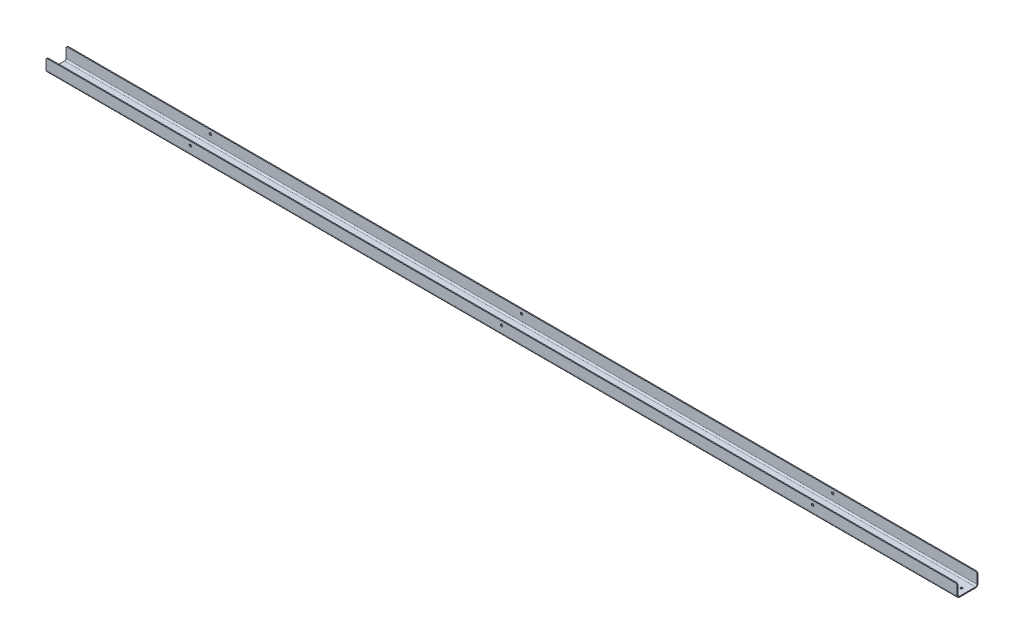
ISO-10303-21;
HEADER;
FILE_DESCRIPTION(('STEP AP214'),'2;1');
FILE_NAME('part.step','',(''),(''),'','','');
FILE_SCHEMA(('AUTOMOTIVE_DESIGN { 1 0 10303 214 1 1 1 1 }'));
ENDSEC;
DATA;
#1=APPLICATION_CONTEXT('core data for automotive mechanical design processes');
#2=APPLICATION_PROTOCOL_DEFINITION('international standard','automotive_design',2000,#1);
#3=PRODUCT_CONTEXT('',#1,'mechanical');
#4=PRODUCT('Part','Part','',(#3));
#5=PRODUCT_RELATED_PRODUCT_CATEGORY('part','',(#4));
#6=PRODUCT_DEFINITION_FORMATION('','',#4);
#7=PRODUCT_DEFINITION_CONTEXT('part definition',#1,'design');
#8=PRODUCT_DEFINITION('design','',#6,#7);
#9=PRODUCT_DEFINITION_SHAPE('','',#8);
#10=(LENGTH_UNIT() NAMED_UNIT(*) SI_UNIT(.MILLI.,.METRE.));
#11=(NAMED_UNIT(*) PLANE_ANGLE_UNIT() SI_UNIT($,.RADIAN.));
#12=(NAMED_UNIT(*) SI_UNIT($,.STERADIAN.) SOLID_ANGLE_UNIT());
#13=UNCERTAINTY_MEASURE_WITH_UNIT(LENGTH_MEASURE(1.E-05),#10,'distance_accuracy_value','');
#14=(GEOMETRIC_REPRESENTATION_CONTEXT(3) GLOBAL_UNCERTAINTY_ASSIGNED_CONTEXT((#13)) GLOBAL_UNIT_ASSIGNED_CONTEXT((#10,
#11,#12)) REPRESENTATION_CONTEXT('',''));
#15=CARTESIAN_POINT('',(0.,0.,0.));
#16=DIRECTION('',(0.,0.,1.));
#17=DIRECTION('',(1.,0.,0.));
#18=AXIS2_PLACEMENT_3D('',#15,#16,#17);
#19=CARTESIAN_POINT('',(1928.8125,5.207,0.));
#20=DIRECTION('',(1.,0.,0.));
#21=DIRECTION('',(0.,0.,-1.));
#22=AXIS2_PLACEMENT_3D('',#19,#20,#21);
#23=PLANE('',#22);
#24=DIRECTION('',(0.,0.,-1.));
#25=VECTOR('',#24,1.);
#26=CARTESIAN_POINT('',(1928.8125,5.207,0.));
#27=LINE('',#26,#25);
#28=CARTESIAN_POINT('',(1928.8125,5.207,0.));
#29=VERTEX_POINT('',#28);
#30=CARTESIAN_POINT('',(1928.8125,5.207,-2.032));
#31=VERTEX_POINT('',#30);
#32=EDGE_CURVE('E314',#29,#31,#27,.T.);
#33=ORIENTED_EDGE('',*,*,#32,.F.);
#34=CARTESIAN_POINT('',(1928.8125,5.207,-5.207));
#35=DIRECTION('',(-1.,0.,0.));
#36=DIRECTION('',(0.,0.,1.));
#37=AXIS2_PLACEMENT_3D('',#34,#35,#36);
#38=CIRCLE('',#37,5.207);
#39=CARTESIAN_POINT('',(1928.8125,0.,-5.207));
#40=VERTEX_POINT('',#39);
#41=EDGE_CURVE('E211',#29,#40,#38,.F.);
#42=ORIENTED_EDGE('',*,*,#41,.T.);
#43=DIRECTION('',(0.,-1.,0.));
#44=VECTOR('',#43,1.);
#45=CARTESIAN_POINT('',(1928.8125,2.032,-5.207));
#46=LINE('',#45,#44);
#47=CARTESIAN_POINT('',(1928.8125,2.032,-5.207));
#48=VERTEX_POINT('',#47);
#49=EDGE_CURVE('E311',#48,#40,#46,.T.);
#50=ORIENTED_EDGE('',*,*,#49,.F.);
#51=CARTESIAN_POINT('',(1928.8125,5.207,-5.207));
#52=DIRECTION('',(1.,0.,0.));
#53=DIRECTION('',(0.,0.,-1.));
#54=AXIS2_PLACEMENT_3D('',#51,#52,#53);
#55=CIRCLE('',#54,3.175);
#56=EDGE_CURVE('E198',#31,#48,#55,.T.);
#57=ORIENTED_EDGE('',*,*,#56,.F.);
#58=EDGE_LOOP('',(#33,#42,#50,#57));
#59=FACE_BOUND('',#58,.T.);
#60=ADVANCED_FACE('F42',(#59),#23,.T.);
#61=CARTESIAN_POINT('',(1928.8125,2.032,-5.207));
#62=DIRECTION('',(1.,0.,0.));
#63=DIRECTION('',(0.,0.,-1.));
#64=AXIS2_PLACEMENT_3D('',#61,#62,#63);
#65=PLANE('',#64);
#66=DIRECTION('',(0.,-1.,0.));
#67=VECTOR('',#66,1.);
#68=CARTESIAN_POINT('',(1928.8125,27.432,-2.032));
#69=LINE('',#68,#67);
#70=CARTESIAN_POINT('',(1928.8125,24.257,-2.032));
#71=VERTEX_POINT('',#70);
#72=EDGE_CURVE('E205',#71,#31,#69,.T.);
#73=ORIENTED_EDGE('',*,*,#72,.F.);
#74=DIRECTION('',(0.,0.,-1.));
#75=VECTOR('',#74,1.);
#76=CARTESIAN_POINT('',(1928.8125,24.257,-5.207));
#77=LINE('',#76,#75);
#78=CARTESIAN_POINT('',(1928.8125,24.257,0.));
#79=VERTEX_POINT('',#78);
#80=EDGE_CURVE('E331',#71,#79,#77,.F.);
#81=ORIENTED_EDGE('',*,*,#80,.T.);
#82=DIRECTION('',(0.,-1.,0.));
#83=VECTOR('',#82,1.);
#84=CARTESIAN_POINT('',(1928.8125,27.432,0.));
#85=LINE('',#84,#83);
#86=EDGE_CURVE('E208',#79,#29,#85,.T.);
#87=ORIENTED_EDGE('',*,*,#86,.T.);
#88=ORIENTED_EDGE('',*,*,#32,.T.);
#89=EDGE_LOOP('',(#73,#81,#87,#88));
#90=FACE_BOUND('',#89,.T.);
#91=ADVANCED_FACE('F402',(#90),#65,.T.);
#92=CARTESIAN_POINT('',(0.,0.,-5.207));
#93=DIRECTION('',(-1.,0.,0.));
#94=DIRECTION('',(0.,0.,1.));
#95=AXIS2_PLACEMENT_3D('',#92,#93,#94);
#96=PLANE('',#95);
#97=DIRECTION('',(0.,1.,0.));
#98=VECTOR('',#97,1.);
#99=CARTESIAN_POINT('',(0.,0.,-5.207));
#100=LINE('',#99,#98);
#101=CARTESIAN_POINT('',(0.,0.,-5.207));
#102=VERTEX_POINT('',#101);
#103=CARTESIAN_POINT('',(0.,2.032,-5.207));
#104=VERTEX_POINT('',#103);
#105=EDGE_CURVE('E308',#102,#104,#100,.T.);
#106=ORIENTED_EDGE('',*,*,#105,.F.);
#107=CARTESIAN_POINT('',(0.,5.207,-5.207));
#108=DIRECTION('',(-1.,0.,0.));
#109=DIRECTION('',(0.,0.,1.));
#110=AXIS2_PLACEMENT_3D('',#107,#108,#109);
#111=CIRCLE('',#110,5.207);
#112=CARTESIAN_POINT('',(0.,5.207,0.));
#113=VERTEX_POINT('',#112);
#114=EDGE_CURVE('E246',#113,#102,#111,.F.);
#115=ORIENTED_EDGE('',*,*,#114,.F.);
#116=DIRECTION('',(0.,0.,1.));
#117=VECTOR('',#116,1.);
#118=CARTESIAN_POINT('',(0.,5.207,-2.032));
#119=LINE('',#118,#117);
#120=CARTESIAN_POINT('',(0.,5.207,-2.032));
#121=VERTEX_POINT('',#120);
#122=EDGE_CURVE('E304',#121,#113,#119,.T.);
#123=ORIENTED_EDGE('',*,*,#122,.F.);
#124=CARTESIAN_POINT('',(0.,5.207,-5.207));
#125=DIRECTION('',(1.,0.,0.));
#126=DIRECTION('',(0.,0.,-1.));
#127=AXIS2_PLACEMENT_3D('',#124,#125,#126);
#128=CIRCLE('',#127,3.175);
#129=EDGE_CURVE('E236',#121,#104,#128,.T.);
#130=ORIENTED_EDGE('',*,*,#129,.T.);
#131=EDGE_LOOP('',(#106,#115,#123,#130));
#132=FACE_BOUND('',#131,.T.);
#133=ADVANCED_FACE('F382',(#132),#96,.T.);
#134=CARTESIAN_POINT('',(0.,5.207,-2.032));
#135=DIRECTION('',(-1.,0.,0.));
#136=DIRECTION('',(0.,0.,1.));
#137=AXIS2_PLACEMENT_3D('',#134,#135,#136);
#138=PLANE('',#137);
#139=DIRECTION('',(0.,0.,-1.));
#140=VECTOR('',#139,1.);
#141=CARTESIAN_POINT('',(0.,0.,0.));
#142=LINE('',#141,#140);
#143=CARTESIAN_POINT('',(0.,0.,-39.243));
#144=VERTEX_POINT('',#143);
#145=EDGE_CURVE('E250',#102,#144,#142,.T.);
#146=ORIENTED_EDGE('',*,*,#145,.F.);
#147=ORIENTED_EDGE('',*,*,#105,.T.);
#148=DIRECTION('',(0.,0.,-1.));
#149=VECTOR('',#148,1.);
#150=CARTESIAN_POINT('',(0.,2.032,0.));
#151=LINE('',#150,#149);
#152=CARTESIAN_POINT('',(0.,2.032,-39.243));
#153=VERTEX_POINT('',#152);
#154=EDGE_CURVE('E232',#104,#153,#151,.T.);
#155=ORIENTED_EDGE('',*,*,#154,.T.);
#156=DIRECTION('',(0.,-1.,0.));
#157=VECTOR('',#156,1.);
#158=CARTESIAN_POINT('',(0.,2.032,-39.243));
#159=LINE('',#158,#157);
#160=EDGE_CURVE('E297',#153,#144,#159,.T.);
#161=ORIENTED_EDGE('',*,*,#160,.T.);
#162=EDGE_LOOP('',(#146,#147,#155,#161));
#163=FACE_BOUND('',#162,.T.);
#164=ADVANCED_FACE('F429',(#163),#138,.T.);
#165=CARTESIAN_POINT('',(1928.8125,0.,-39.243));
#166=DIRECTION('',(1.,0.,0.));
#167=DIRECTION('',(0.,0.,-1.));
#168=AXIS2_PLACEMENT_3D('',#165,#166,#167);
#169=PLANE('',#168);
#170=DIRECTION('',(0.,1.,0.));
#171=VECTOR('',#170,1.);
#172=CARTESIAN_POINT('',(1928.8125,0.,-39.243));
#173=LINE('',#172,#171);
#174=CARTESIAN_POINT('',(1928.8125,0.,-39.243));
#175=VERTEX_POINT('',#174);
#176=CARTESIAN_POINT('',(1928.8125,2.032,-39.243));
#177=VERTEX_POINT('',#176);
#178=EDGE_CURVE('E170',#175,#177,#173,.T.);
#179=ORIENTED_EDGE('',*,*,#178,.F.);
#180=CARTESIAN_POINT('',(1928.8125,5.207,-39.243));
#181=DIRECTION('',(-1.,0.,0.));
#182=DIRECTION('',(0.,0.,1.));
#183=AXIS2_PLACEMENT_3D('',#180,#181,#182);
#184=CIRCLE('',#183,5.207);
#185=CARTESIAN_POINT('',(1928.8125,5.207,-44.45));
#186=VERTEX_POINT('',#185);
#187=EDGE_CURVE('E167',#175,#186,#184,.F.);
#188=ORIENTED_EDGE('',*,*,#187,.T.);
#189=DIRECTION('',(0.,0.,-1.));
#190=VECTOR('',#189,1.);
#191=CARTESIAN_POINT('',(1928.8125,5.207,-42.418));
#192=LINE('',#191,#190);
#193=CARTESIAN_POINT('',(1928.8125,5.207,-42.418));
#194=VERTEX_POINT('',#193);
#195=EDGE_CURVE('E160',#194,#186,#192,.T.);
#196=ORIENTED_EDGE('',*,*,#195,.F.);
#197=CARTESIAN_POINT('',(1928.8125,5.207,-39.243));
#198=DIRECTION('',(1.,0.,0.));
#199=DIRECTION('',(0.,0.,-1.));
#200=AXIS2_PLACEMENT_3D('',#197,#198,#199);
#201=CIRCLE('',#200,3.175);
#202=EDGE_CURVE('E164',#177,#194,#201,.T.);
#203=ORIENTED_EDGE('',*,*,#202,.F.);
#204=EDGE_LOOP('',(#179,#188,#196,#203));
#205=FACE_BOUND('',#204,.T.);
#206=ADVANCED_FACE('F162',(#205),#169,.T.);
#207=CARTESIAN_POINT('',(1928.8125,5.207,-42.418));
#208=DIRECTION('',(1.,0.,0.));
#209=DIRECTION('',(0.,0.,-1.));
#210=AXIS2_PLACEMENT_3D('',#207,#208,#209);
#211=PLANE('',#210);
#212=DIRECTION('',(0.,0.,-1.));
#213=VECTOR('',#212,1.);
#214=CARTESIAN_POINT('',(1928.8125,0.,0.));
#215=LINE('',#214,#213);
#216=EDGE_CURVE('E215',#40,#175,#215,.T.);
#217=ORIENTED_EDGE('',*,*,#216,.T.);
#218=ORIENTED_EDGE('',*,*,#178,.T.);
#219=DIRECTION('',(0.,0.,-1.));
#220=VECTOR('',#219,1.);
#221=CARTESIAN_POINT('',(1928.8125,2.032,0.));
#222=LINE('',#221,#220);
#223=EDGE_CURVE('E194',#48,#177,#222,.T.);
#224=ORIENTED_EDGE('',*,*,#223,.F.);
#225=ORIENTED_EDGE('',*,*,#49,.T.);
#226=EDGE_LOOP('',(#217,#218,#224,#225));
#227=FACE_BOUND('',#226,.T.);
#228=ADVANCED_FACE('F435',(#227),#211,.T.);
#229=CARTESIAN_POINT('',(0.,5.207,-44.45));
#230=DIRECTION('',(-1.,0.,0.));
#231=DIRECTION('',(0.,0.,1.));
#232=AXIS2_PLACEMENT_3D('',#229,#230,#231);
#233=PLANE('',#232);
#234=DIRECTION('',(0.,0.,1.));
#235=VECTOR('',#234,1.);
#236=CARTESIAN_POINT('',(0.,5.207,-44.45));
#237=LINE('',#236,#235);
#238=CARTESIAN_POINT('',(0.,5.207,-44.45));
#239=VERTEX_POINT('',#238);
#240=CARTESIAN_POINT('',(0.,5.207,-42.418));
#241=VERTEX_POINT('',#240);
#242=EDGE_CURVE('E171',#239,#241,#237,.T.);
#243=ORIENTED_EDGE('',*,*,#242,.F.);
#244=CARTESIAN_POINT('',(0.,5.207,-39.243));
#245=DIRECTION('',(-1.,0.,0.));
#246=DIRECTION('',(0.,0.,1.));
#247=AXIS2_PLACEMENT_3D('',#244,#245,#246);
#248=CIRCLE('',#247,5.207);
#249=EDGE_CURVE('E254',#144,#239,#248,.F.);
#250=ORIENTED_EDGE('',*,*,#249,.F.);
#251=ORIENTED_EDGE('',*,*,#160,.F.);
#252=CARTESIAN_POINT('',(0.,5.207,-39.243));
#253=DIRECTION('',(1.,0.,0.));
#254=DIRECTION('',(0.,0.,-1.));
#255=AXIS2_PLACEMENT_3D('',#252,#253,#254);
#256=CIRCLE('',#255,3.175);
#257=EDGE_CURVE('E229',#153,#241,#256,.T.);
#258=ORIENTED_EDGE('',*,*,#257,.T.);
#259=EDGE_LOOP('',(#243,#250,#251,#258));
#260=FACE_BOUND('',#259,.T.);
#261=ADVANCED_FACE('F438',(#260),#233,.T.);
#262=CARTESIAN_POINT('',(0.,2.032,-39.243));
#263=DIRECTION('',(-1.,0.,0.));
#264=DIRECTION('',(0.,0.,1.));
#265=AXIS2_PLACEMENT_3D('',#262,#263,#264);
#266=PLANE('',#265);
#267=DIRECTION('',(0.,1.,0.));
#268=VECTOR('',#267,1.);
#269=CARTESIAN_POINT('',(0.,0.,-42.418));
#270=LINE('',#269,#268);
#271=CARTESIAN_POINT('',(0.,24.257,-42.418));
#272=VERTEX_POINT('',#271);
#273=EDGE_CURVE('E178',#241,#272,#270,.T.);
#274=ORIENTED_EDGE('',*,*,#273,.T.);
#275=DIRECTION('',(0.,0.,-1.));
#276=VECTOR('',#275,1.);
#277=CARTESIAN_POINT('',(0.,24.257,-39.243));
#278=LINE('',#277,#276);
#279=CARTESIAN_POINT('',(0.,24.257,-44.45));
#280=VERTEX_POINT('',#279);
#281=EDGE_CURVE('E11',#272,#280,#278,.T.);
#282=ORIENTED_EDGE('',*,*,#281,.T.);
#283=DIRECTION('',(0.,1.,0.));
#284=VECTOR('',#283,1.);
#285=CARTESIAN_POINT('',(0.,0.,-44.45));
#286=LINE('',#285,#284);
#287=EDGE_CURVE('E222',#239,#280,#286,.T.);
#288=ORIENTED_EDGE('',*,*,#287,.F.);
#289=ORIENTED_EDGE('',*,*,#242,.T.);
#290=EDGE_LOOP('',(#274,#282,#288,#289));
#291=FACE_BOUND('',#290,.T.);
#292=ADVANCED_FACE('F442',(#291),#266,.T.);
#293=CARTESIAN_POINT('',(1928.8125,0.,-44.45));
#294=DIRECTION('',(0.,0.,1.));
#295=DIRECTION('',(1.,0.,0.));
#296=AXIS2_PLACEMENT_3D('',#293,#294,#295);
#297=PLANE('',#296);
#298=CARTESIAN_POINT('',(1623.21875,19.05,-44.45));
#299=DIRECTION('',(0.,0.,-1.));
#300=DIRECTION('',(-1.,0.,0.));
#301=AXIS2_PLACEMENT_3D('',#298,#299,#300);
#302=CIRCLE('',#301,2.45110000000003);
#303=CARTESIAN_POINT('',(1620.76765,19.05,-44.45));
#304=VERTEX_POINT('',#303);
#305=EDGE_CURVE('E543',#304,#304,#302,.T.);
#306=ORIENTED_EDGE('',*,*,#305,.F.);
#307=EDGE_LOOP('',(#306));
#308=FACE_BOUND('',#307,.T.);
#309=CARTESIAN_POINT('',(964.40625,19.05,-44.45));
#310=DIRECTION('',(0.,0.,-1.));
#311=DIRECTION('',(-1.,0.,0.));
#312=AXIS2_PLACEMENT_3D('',#309,#310,#311);
#313=CIRCLE('',#312,2.45110000000003);
#314=CARTESIAN_POINT('',(961.95515,19.05,-44.45));
#315=VERTEX_POINT('',#314);
#316=EDGE_CURVE('E558',#315,#315,#313,.T.);
#317=ORIENTED_EDGE('',*,*,#316,.F.);
#318=EDGE_LOOP('',(#317));
#319=FACE_BOUND('',#318,.T.);
#320=CARTESIAN_POINT('',(305.59375,19.05,-44.45));
#321=DIRECTION('',(0.,0.,-1.));
#322=DIRECTION('',(-1.,0.,0.));
#323=AXIS2_PLACEMENT_3D('',#320,#321,#322);
#324=CIRCLE('',#323,2.45109999999997);
#325=CARTESIAN_POINT('',(303.14265,19.05,-44.45));
#326=VERTEX_POINT('',#325);
#327=EDGE_CURVE('E566',#326,#326,#324,.T.);
#328=ORIENTED_EDGE('',*,*,#327,.F.);
#329=EDGE_LOOP('',(#328));
#330=FACE_BOUND('',#329,.T.);
#331=DIRECTION('',(-1.,0.,0.));
#332=VECTOR('',#331,1.);
#333=CARTESIAN_POINT('',(1928.8125,27.432,-44.45));
#334=LINE('',#333,#332);
#335=CARTESIAN_POINT('',(1925.6375,27.432,-44.45));
#336=VERTEX_POINT('',#335);
#337=CARTESIAN_POINT('',(3.17499999999993,27.432,-44.45));
#338=VERTEX_POINT('',#337);
#339=EDGE_CURVE('E293',#336,#338,#334,.T.);
#340=ORIENTED_EDGE('',*,*,#339,.F.);
#341=CARTESIAN_POINT('',(1925.6375,24.257,-44.45));
#342=DIRECTION('',(0.,0.,1.));
#343=DIRECTION('',(1.,0.,0.));
#344=AXIS2_PLACEMENT_3D('',#341,#342,#343);
#345=CIRCLE('',#344,3.175);
#346=CARTESIAN_POINT('',(1928.8125,24.257,-44.45));
#347=VERTEX_POINT('',#346);
#348=EDGE_CURVE('E350',#336,#347,#345,.F.);
#349=ORIENTED_EDGE('',*,*,#348,.T.);
#350=DIRECTION('',(0.,1.,0.));
#351=VECTOR('',#350,1.);
#352=CARTESIAN_POINT('',(1928.8125,0.,-44.45));
#353=LINE('',#352,#351);
#354=EDGE_CURVE('E188',#186,#347,#353,.T.);
#355=ORIENTED_EDGE('',*,*,#354,.F.);
#356=DIRECTION('',(-1.,0.,0.));
#357=VECTOR('',#356,1.);
#358=CARTESIAN_POINT('',(1928.8125,5.207,-44.45));
#359=LINE('',#358,#357);
#360=EDGE_CURVE('E221',#186,#239,#359,.T.);
#361=ORIENTED_EDGE('',*,*,#360,.T.);
#362=ORIENTED_EDGE('',*,*,#287,.T.);
#363=CARTESIAN_POINT('',(3.175,24.257,-44.45));
#364=DIRECTION('',(0.,0.,1.));
#365=DIRECTION('',(1.,0.,0.));
#366=AXIS2_PLACEMENT_3D('',#363,#364,#365);
#367=CIRCLE('',#366,3.175);
#368=EDGE_CURVE('E347',#280,#338,#367,.F.);
#369=ORIENTED_EDGE('',*,*,#368,.T.);
#370=EDGE_LOOP('',(#340,#349,#355,#361,#362,#369));
#371=FACE_BOUND('',#370,.T.);
#372=ADVANCED_FACE('F446',(#308,#319,#330,#371),#297,.F.);
#373=CARTESIAN_POINT('',(1928.8125,27.432,-42.418));
#374=DIRECTION('',(0.,1.,0.));
#375=DIRECTION('',(0.,0.,1.));
#376=AXIS2_PLACEMENT_3D('',#373,#374,#375);
#377=PLANE('',#376);
#378=DIRECTION('',(-1.,0.,0.));
#379=VECTOR('',#378,1.);
#380=CARTESIAN_POINT('',(1928.8125,27.432,-42.418));
#381=LINE('',#380,#379);
#382=CARTESIAN_POINT('',(1925.6375,27.432,-42.418));
#383=VERTEX_POINT('',#382);
#384=CARTESIAN_POINT('',(3.17499999999993,27.432,-42.418));
#385=VERTEX_POINT('',#384);
#386=EDGE_CURVE('E183',#383,#385,#381,.T.);
#387=ORIENTED_EDGE('',*,*,#386,.F.);
#388=DIRECTION('',(0.,0.,-1.));
#389=VECTOR('',#388,1.);
#390=CARTESIAN_POINT('',(1925.6375,27.432,-42.418));
#391=LINE('',#390,#389);
#392=EDGE_CURVE('E343',#383,#336,#391,.T.);
#393=ORIENTED_EDGE('',*,*,#392,.T.);
#394=ORIENTED_EDGE('',*,*,#339,.T.);
#395=DIRECTION('',(0.,0.,-1.));
#396=VECTOR('',#395,1.);
#397=CARTESIAN_POINT('',(3.17499999999993,27.432,-42.418));
#398=LINE('',#397,#396);
#399=EDGE_CURVE('E340',#338,#385,#398,.F.);
#400=ORIENTED_EDGE('',*,*,#399,.T.);
#401=EDGE_LOOP('',(#387,#393,#394,#400));
#402=FACE_BOUND('',#401,.T.);
#403=ADVANCED_FACE('F450',(#402),#377,.T.);
#404=CARTESIAN_POINT('',(1928.8125,0.,-42.418));
#405=DIRECTION('',(0.,0.,1.));
#406=DIRECTION('',(1.,0.,0.));
#407=AXIS2_PLACEMENT_3D('',#404,#405,#406);
#408=PLANE('',#407);
#409=CARTESIAN_POINT('',(1623.21875,19.05,-42.418));
#410=DIRECTION('',(0.,0.,1.));
#411=DIRECTION('',(1.,0.,0.));
#412=AXIS2_PLACEMENT_3D('',#409,#410,#411);
#413=CIRCLE('',#412,2.45110000000003);
#414=CARTESIAN_POINT('',(1625.66985,19.05,-42.418));
#415=VERTEX_POINT('',#414);
#416=EDGE_CURVE('E583',#415,#415,#413,.T.);
#417=ORIENTED_EDGE('',*,*,#416,.F.);
#418=EDGE_LOOP('',(#417));
#419=FACE_BOUND('',#418,.T.);
#420=CARTESIAN_POINT('',(964.40625,19.05,-42.418));
#421=DIRECTION('',(0.,0.,1.));
#422=DIRECTION('',(1.,0.,0.));
#423=AXIS2_PLACEMENT_3D('',#420,#421,#422);
#424=CIRCLE('',#423,2.45110000000003);
#425=CARTESIAN_POINT('',(966.85735,19.05,-42.418));
#426=VERTEX_POINT('',#425);
#427=EDGE_CURVE('E577',#426,#426,#424,.T.);
#428=ORIENTED_EDGE('',*,*,#427,.F.);
#429=EDGE_LOOP('',(#428));
#430=FACE_BOUND('',#429,.T.);
#431=CARTESIAN_POINT('',(305.59375,19.05,-42.418));
#432=DIRECTION('',(0.,0.,1.));
#433=DIRECTION('',(1.,0.,0.));
#434=AXIS2_PLACEMENT_3D('',#431,#432,#433);
#435=CIRCLE('',#434,2.45109999999997);
#436=CARTESIAN_POINT('',(308.04485,19.05,-42.418));
#437=VERTEX_POINT('',#436);
#438=EDGE_CURVE('E549',#437,#437,#435,.T.);
#439=ORIENTED_EDGE('',*,*,#438,.F.);
#440=EDGE_LOOP('',(#439));
#441=FACE_BOUND('',#440,.T.);
#442=DIRECTION('',(0.,1.,0.));
#443=VECTOR('',#442,1.);
#444=CARTESIAN_POINT('',(1928.8125,0.,-42.418));
#445=LINE('',#444,#443);
#446=CARTESIAN_POINT('',(1928.8125,24.257,-42.418));
#447=VERTEX_POINT('',#446);
#448=EDGE_CURVE('E176',#194,#447,#445,.T.);
#449=ORIENTED_EDGE('',*,*,#448,.T.);
#450=CARTESIAN_POINT('',(1925.6375,24.257,-42.418));
#451=DIRECTION('',(0.,0.,1.));
#452=DIRECTION('',(1.,0.,0.));
#453=AXIS2_PLACEMENT_3D('',#450,#451,#452);
#454=CIRCLE('',#453,3.175);
#455=EDGE_CURVE('E357',#447,#383,#454,.T.);
#456=ORIENTED_EDGE('',*,*,#455,.T.);
#457=ORIENTED_EDGE('',*,*,#386,.T.);
#458=CARTESIAN_POINT('',(3.175,24.257,-42.418));
#459=DIRECTION('',(0.,0.,1.));
#460=DIRECTION('',(1.,0.,0.));
#461=AXIS2_PLACEMENT_3D('',#458,#459,#460);
#462=CIRCLE('',#461,3.175);
#463=EDGE_CURVE('E58',#385,#272,#462,.T.);
#464=ORIENTED_EDGE('',*,*,#463,.T.);
#465=ORIENTED_EDGE('',*,*,#273,.F.);
#466=DIRECTION('',(-1.,0.,0.));
#467=VECTOR('',#466,1.);
#468=CARTESIAN_POINT('',(1928.8125,5.207,-42.418));
#469=LINE('',#468,#467);
#470=EDGE_CURVE('E174',#194,#241,#469,.T.);
#471=ORIENTED_EDGE('',*,*,#470,.F.);
#472=EDGE_LOOP('',(#449,#456,#457,#464,#465,#471));
#473=FACE_BOUND('',#472,.T.);
#474=ADVANCED_FACE('F175',(#419,#430,#441,#473),#408,.T.);
#475=CARTESIAN_POINT('',(1928.8125,5.207,-39.243));
#476=DIRECTION('',(-1.,0.,0.));
#477=DIRECTION('',(0.,0.,1.));
#478=AXIS2_PLACEMENT_3D('',#475,#476,#477);
#479=CYLINDRICAL_SURFACE('',#478,3.175);
#480=ORIENTED_EDGE('',*,*,#257,.F.);
#481=DIRECTION('',(-1.,0.,0.));
#482=VECTOR('',#481,1.);
#483=CARTESIAN_POINT('',(1928.8125,2.032,-39.243));
#484=LINE('',#483,#482);
#485=EDGE_CURVE('E184',#177,#153,#484,.T.);
#486=ORIENTED_EDGE('',*,*,#485,.F.);
#487=ORIENTED_EDGE('',*,*,#202,.T.);
#488=ORIENTED_EDGE('',*,*,#470,.T.);
#489=EDGE_LOOP('',(#480,#486,#487,#488));
#490=FACE_BOUND('',#489,.T.);
#491=ADVANCED_FACE('F191',(#490),#479,.F.);
#492=CARTESIAN_POINT('',(1928.8125,2.032,0.));
#493=DIRECTION('',(0.,1.,0.));
#494=DIRECTION('',(0.,0.,1.));
#495=AXIS2_PLACEMENT_3D('',#492,#493,#494);
#496=PLANE('',#495);
#497=CARTESIAN_POINT('',(12.7,2.032,-22.2250000000001));
#498=DIRECTION('',(0.,1.,0.));
#499=DIRECTION('',(0.,0.,1.));
#500=AXIS2_PLACEMENT_3D('',#497,#498,#499);
#501=CIRCLE('',#500,2.4511);
#502=CARTESIAN_POINT('',(12.7,2.032,-19.7739000000001));
#503=VERTEX_POINT('',#502);
#504=EDGE_CURVE('E226',#503,#503,#501,.T.);
#505=ORIENTED_EDGE('',*,*,#504,.F.);
#506=EDGE_LOOP('',(#505));
#507=FACE_BOUND('',#506,.T.);
#508=CARTESIAN_POINT('',(1258.85575,2.032,-22.2250000000001));
#509=DIRECTION('',(0.,1.,0.));
#510=DIRECTION('',(0.,0.,1.));
#511=AXIS2_PLACEMENT_3D('',#508,#509,#510);
#512=CIRCLE('',#511,2.45110000000003);
#513=CARTESIAN_POINT('',(1258.85575,2.032,-19.7739));
#514=VERTEX_POINT('',#513);
#515=EDGE_CURVE('E643',#514,#514,#512,.T.);
#516=ORIENTED_EDGE('',*,*,#515,.F.);
#517=EDGE_LOOP('',(#516));
#518=FACE_BOUND('',#517,.T.);
#519=CARTESIAN_POINT('',(1277.90575,2.032,-22.2250000000001));
#520=DIRECTION('',(0.,1.,0.));
#521=DIRECTION('',(0.,0.,1.));
#522=AXIS2_PLACEMENT_3D('',#519,#520,#521);
#523=CIRCLE('',#522,2.45110000000003);
#524=CARTESIAN_POINT('',(1277.90575,2.032,-19.7739));
#525=VERTEX_POINT('',#524);
#526=EDGE_CURVE('E639',#525,#525,#523,.T.);
#527=ORIENTED_EDGE('',*,*,#526,.F.);
#528=EDGE_LOOP('',(#527));
#529=FACE_BOUND('',#528,.T.);
#530=CARTESIAN_POINT('',(1897.0625,2.032,-22.2250000000001));
#531=DIRECTION('',(0.,1.,0.));
#532=DIRECTION('',(0.,0.,1.));
#533=AXIS2_PLACEMENT_3D('',#530,#531,#532);
#534=CIRCLE('',#533,2.45110000000003);
#535=CARTESIAN_POINT('',(1897.0625,2.032,-19.7739000000001));
#536=VERTEX_POINT('',#535);
#537=EDGE_CURVE('E635',#536,#536,#534,.T.);
#538=ORIENTED_EDGE('',*,*,#537,.F.);
#539=EDGE_LOOP('',(#538));
#540=FACE_BOUND('',#539,.T.);
#541=CARTESIAN_POINT('',(1916.1125,2.032,-22.2250000000001));
#542=DIRECTION('',(0.,1.,0.));
#543=DIRECTION('',(0.,0.,1.));
#544=AXIS2_PLACEMENT_3D('',#541,#542,#543);
#545=CIRCLE('',#544,2.45110000000003);
#546=CARTESIAN_POINT('',(1916.1125,2.032,-19.7739000000001));
#547=VERTEX_POINT('',#546);
#548=EDGE_CURVE('E631',#547,#547,#545,.T.);
#549=ORIENTED_EDGE('',*,*,#548,.F.);
#550=EDGE_LOOP('',(#549));
#551=FACE_BOUND('',#550,.T.);
#552=CARTESIAN_POINT('',(669.95675,2.032,-22.2250000000001));
#553=DIRECTION('',(0.,1.,0.));
#554=DIRECTION('',(0.,0.,1.));
#555=AXIS2_PLACEMENT_3D('',#552,#553,#554);
#556=CIRCLE('',#555,2.45110000000003);
#557=CARTESIAN_POINT('',(669.95675,2.032,-19.7739));
#558=VERTEX_POINT('',#557);
#559=EDGE_CURVE('E627',#558,#558,#556,.T.);
#560=ORIENTED_EDGE('',*,*,#559,.F.);
#561=EDGE_LOOP('',(#560));
#562=FACE_BOUND('',#561,.T.);
#563=CARTESIAN_POINT('',(650.90675,2.032,-22.2250000000001));
#564=DIRECTION('',(0.,1.,0.));
#565=DIRECTION('',(0.,0.,1.));
#566=AXIS2_PLACEMENT_3D('',#563,#564,#565);
#567=CIRCLE('',#566,2.45110000000003);
#568=CARTESIAN_POINT('',(650.90675,2.032,-19.7739));
#569=VERTEX_POINT('',#568);
#570=EDGE_CURVE('E623',#569,#569,#567,.T.);
#571=ORIENTED_EDGE('',*,*,#570,.F.);
#572=EDGE_LOOP('',(#571));
#573=FACE_BOUND('',#572,.T.);
#574=CARTESIAN_POINT('',(31.75,2.032,-22.2250000000001));
#575=DIRECTION('',(0.,1.,0.));
#576=DIRECTION('',(0.,0.,1.));
#577=AXIS2_PLACEMENT_3D('',#574,#575,#576);
#578=CIRCLE('',#577,2.4511);
#579=CARTESIAN_POINT('',(31.75,2.032,-19.7739000000001));
#580=VERTEX_POINT('',#579);
#581=EDGE_CURVE('E592',#580,#580,#578,.T.);
#582=ORIENTED_EDGE('',*,*,#581,.F.);
#583=EDGE_LOOP('',(#582));
#584=FACE_BOUND('',#583,.T.);
#585=ORIENTED_EDGE('',*,*,#154,.F.);
#586=DIRECTION('',(-1.,0.,0.));
#587=VECTOR('',#586,1.);
#588=CARTESIAN_POINT('',(1928.8125,2.032,-5.207));
#589=LINE('',#588,#587);
#590=EDGE_CURVE('E285',#48,#104,#589,.T.);
#591=ORIENTED_EDGE('',*,*,#590,.F.);
#592=ORIENTED_EDGE('',*,*,#223,.T.);
#593=ORIENTED_EDGE('',*,*,#485,.T.);
#594=EDGE_LOOP('',(#585,#591,#592,#593));
#595=FACE_BOUND('',#594,.T.);
#596=ADVANCED_FACE('F460',(#507,#518,#529,#540,#551,#562,#573,#584,#595),#496,.T.);
#597=CARTESIAN_POINT('',(1928.8125,5.207,-5.207));
#598=DIRECTION('',(-1.,0.,0.));
#599=DIRECTION('',(0.,0.,1.));
#600=AXIS2_PLACEMENT_3D('',#597,#598,#599);
#601=CYLINDRICAL_SURFACE('',#600,3.175);
#602=ORIENTED_EDGE('',*,*,#129,.F.);
#603=DIRECTION('',(-1.,0.,0.));
#604=VECTOR('',#603,1.);
#605=CARTESIAN_POINT('',(1928.8125,5.207,-2.032));
#606=LINE('',#605,#604);
#607=EDGE_CURVE('E281',#31,#121,#606,.T.);
#608=ORIENTED_EDGE('',*,*,#607,.F.);
#609=ORIENTED_EDGE('',*,*,#56,.T.);
#610=ORIENTED_EDGE('',*,*,#590,.T.);
#611=EDGE_LOOP('',(#602,#608,#609,#610));
#612=FACE_BOUND('',#611,.T.);
#613=ADVANCED_FACE('F378',(#612),#601,.F.);
#614=CARTESIAN_POINT('',(1928.8125,27.432,-2.032));
#615=DIRECTION('',(0.,0.,-1.));
#616=DIRECTION('',(0.,1.,0.));
#617=AXIS2_PLACEMENT_3D('',#614,#615,#616);
#618=PLANE('',#617);
#619=CARTESIAN_POINT('',(1623.21875,19.05,-2.032));
#620=DIRECTION('',(0.,0.,-1.));
#621=DIRECTION('',(0.,1.,0.));
#622=AXIS2_PLACEMENT_3D('',#619,#620,#621);
#623=CIRCLE('',#622,2.45110000000003);
#624=CARTESIAN_POINT('',(1623.21875,21.5011,-2.032));
#625=VERTEX_POINT('',#624);
#626=EDGE_CURVE('E537',#625,#625,#623,.T.);
#627=ORIENTED_EDGE('',*,*,#626,.F.);
#628=EDGE_LOOP('',(#627));
#629=FACE_BOUND('',#628,.T.);
#630=CARTESIAN_POINT('',(964.40625,19.05,-2.032));
#631=DIRECTION('',(0.,0.,-1.));
#632=DIRECTION('',(0.,1.,0.));
#633=AXIS2_PLACEMENT_3D('',#630,#631,#632);
#634=CIRCLE('',#633,2.45110000000003);
#635=CARTESIAN_POINT('',(964.40625,21.5011,-2.032));
#636=VERTEX_POINT('',#635);
#637=EDGE_CURVE('E573',#636,#636,#634,.T.);
#638=ORIENTED_EDGE('',*,*,#637,.F.);
#639=EDGE_LOOP('',(#638));
#640=FACE_BOUND('',#639,.T.);
#641=CARTESIAN_POINT('',(305.59375,19.05,-2.032));
#642=DIRECTION('',(0.,0.,-1.));
#643=DIRECTION('',(0.,1.,0.));
#644=AXIS2_PLACEMENT_3D('',#641,#642,#643);
#645=CIRCLE('',#644,2.45109999999997);
#646=CARTESIAN_POINT('',(305.59375,21.5011,-2.032));
#647=VERTEX_POINT('',#646);
#648=EDGE_CURVE('E542',#647,#647,#645,.T.);
#649=ORIENTED_EDGE('',*,*,#648,.F.);
#650=EDGE_LOOP('',(#649));
#651=FACE_BOUND('',#650,.T.);
#652=DIRECTION('',(-1.,0.,0.));
#653=VECTOR('',#652,1.);
#654=CARTESIAN_POINT('',(1928.8125,27.432,-2.032));
#655=LINE('',#654,#653);
#656=CARTESIAN_POINT('',(1925.6375,27.432,-2.032));
#657=VERTEX_POINT('',#656);
#658=CARTESIAN_POINT('',(3.17499999999993,27.432,-2.032));
#659=VERTEX_POINT('',#658);
#660=EDGE_CURVE('E277',#657,#659,#655,.T.);
#661=ORIENTED_EDGE('',*,*,#660,.F.);
#662=CARTESIAN_POINT('',(1925.6375,24.257,-2.032));
#663=DIRECTION('',(0.,0.,-1.));
#664=DIRECTION('',(0.,1.,0.));
#665=AXIS2_PLACEMENT_3D('',#662,#663,#664);
#666=CIRCLE('',#665,3.175);
#667=EDGE_CURVE('E328',#657,#71,#666,.T.);
#668=ORIENTED_EDGE('',*,*,#667,.T.);
#669=ORIENTED_EDGE('',*,*,#72,.T.);
#670=ORIENTED_EDGE('',*,*,#607,.T.);
#671=DIRECTION('',(0.,-1.,0.));
#672=VECTOR('',#671,1.);
#673=CARTESIAN_POINT('',(0.,27.432,-2.032));
#674=LINE('',#673,#672);
#675=CARTESIAN_POINT('',(0.,24.257,-2.032));
#676=VERTEX_POINT('',#675);
#677=EDGE_CURVE('E240',#676,#121,#674,.T.);
#678=ORIENTED_EDGE('',*,*,#677,.F.);
#679=CARTESIAN_POINT('',(3.175,24.257,-2.032));
#680=DIRECTION('',(0.,0.,-1.));
#681=DIRECTION('',(0.,1.,0.));
#682=AXIS2_PLACEMENT_3D('',#679,#680,#681);
#683=CIRCLE('',#682,3.175);
#684=EDGE_CURVE('E325',#676,#659,#683,.T.);
#685=ORIENTED_EDGE('',*,*,#684,.T.);
#686=EDGE_LOOP('',(#661,#668,#669,#670,#678,#685));
#687=FACE_BOUND('',#686,.T.);
#688=ADVANCED_FACE('F372',(#629,#640,#651,#687),#618,.T.);
#689=CARTESIAN_POINT('',(1928.8125,27.432,0.));
#690=DIRECTION('',(0.,1.,0.));
#691=DIRECTION('',(0.,0.,1.));
#692=AXIS2_PLACEMENT_3D('',#689,#690,#691);
#693=PLANE('',#692);
#694=DIRECTION('',(-1.,0.,0.));
#695=VECTOR('',#694,1.);
#696=CARTESIAN_POINT('',(1928.8125,27.432,0.));
#697=LINE('',#696,#695);
#698=CARTESIAN_POINT('',(1925.6375,27.432,0.));
#699=VERTEX_POINT('',#698);
#700=CARTESIAN_POINT('',(3.17499999999993,27.432,0.));
#701=VERTEX_POINT('',#700);
#702=EDGE_CURVE('E273',#699,#701,#697,.T.);
#703=ORIENTED_EDGE('',*,*,#702,.F.);
#704=DIRECTION('',(0.,0.,-1.));
#705=VECTOR('',#704,1.);
#706=CARTESIAN_POINT('',(1925.6375,27.432,0.));
#707=LINE('',#706,#705);
#708=EDGE_CURVE('E321',#699,#657,#707,.T.);
#709=ORIENTED_EDGE('',*,*,#708,.T.);
#710=ORIENTED_EDGE('',*,*,#660,.T.);
#711=DIRECTION('',(0.,0.,-1.));
#712=VECTOR('',#711,1.);
#713=CARTESIAN_POINT('',(3.175,27.432,0.));
#714=LINE('',#713,#712);
#715=EDGE_CURVE('E318',#659,#701,#714,.F.);
#716=ORIENTED_EDGE('',*,*,#715,.T.);
#717=EDGE_LOOP('',(#703,#709,#710,#716));
#718=FACE_BOUND('',#717,.T.);
#719=ADVANCED_FACE('F397',(#718),#693,.T.);
#720=CARTESIAN_POINT('',(1928.8125,27.432,0.));
#721=DIRECTION('',(0.,0.,-1.));
#722=DIRECTION('',(0.,1.,0.));
#723=AXIS2_PLACEMENT_3D('',#720,#721,#722);
#724=PLANE('',#723);
#725=CARTESIAN_POINT('',(1623.21875,19.05,0.));
#726=DIRECTION('',(0.,0.,-1.));
#727=DIRECTION('',(-1.,0.,0.));
#728=AXIS2_PLACEMENT_3D('',#725,#726,#727);
#729=CIRCLE('',#728,2.45110000000003);
#730=CARTESIAN_POINT('',(1620.76765,19.05,0.));
#731=VERTEX_POINT('',#730);
#732=EDGE_CURVE('E540',#731,#731,#729,.T.);
#733=ORIENTED_EDGE('',*,*,#732,.T.);
#734=EDGE_LOOP('',(#733));
#735=FACE_BOUND('',#734,.T.);
#736=CARTESIAN_POINT('',(964.40625,19.05,0.));
#737=DIRECTION('',(0.,0.,-1.));
#738=DIRECTION('',(-1.,0.,0.));
#739=AXIS2_PLACEMENT_3D('',#736,#737,#738);
#740=CIRCLE('',#739,2.45110000000003);
#741=CARTESIAN_POINT('',(961.95515,19.05,0.));
#742=VERTEX_POINT('',#741);
#743=EDGE_CURVE('E552',#742,#742,#740,.T.);
#744=ORIENTED_EDGE('',*,*,#743,.T.);
#745=EDGE_LOOP('',(#744));
#746=FACE_BOUND('',#745,.T.);
#747=CARTESIAN_POINT('',(305.59375,19.05,0.));
#748=DIRECTION('',(0.,0.,-1.));
#749=DIRECTION('',(-1.,0.,0.));
#750=AXIS2_PLACEMENT_3D('',#747,#748,#749);
#751=CIRCLE('',#750,2.45109999999997);
#752=CARTESIAN_POINT('',(303.14265,19.05,0.));
#753=VERTEX_POINT('',#752);
#754=EDGE_CURVE('E562',#753,#753,#751,.T.);
#755=ORIENTED_EDGE('',*,*,#754,.T.);
#756=EDGE_LOOP('',(#755));
#757=FACE_BOUND('',#756,.T.);
#758=ORIENTED_EDGE('',*,*,#86,.F.);
#759=CARTESIAN_POINT('',(1925.6375,24.257,0.));
#760=DIRECTION('',(0.,0.,-1.));
#761=DIRECTION('',(0.,1.,0.));
#762=AXIS2_PLACEMENT_3D('',#759,#760,#761);
#763=CIRCLE('',#762,3.175);
#764=EDGE_CURVE('E337',#79,#699,#763,.F.);
#765=ORIENTED_EDGE('',*,*,#764,.T.);
#766=ORIENTED_EDGE('',*,*,#702,.T.);
#767=CARTESIAN_POINT('',(3.175,24.257,0.));
#768=DIRECTION('',(0.,0.,-1.));
#769=DIRECTION('',(0.,1.,0.));
#770=AXIS2_PLACEMENT_3D('',#767,#768,#769);
#771=CIRCLE('',#770,3.175);
#772=CARTESIAN_POINT('',(0.,24.257,0.));
#773=VERTEX_POINT('',#772);
#774=EDGE_CURVE('E334',#701,#773,#771,.F.);
#775=ORIENTED_EDGE('',*,*,#774,.T.);
#776=DIRECTION('',(0.,-1.,0.));
#777=VECTOR('',#776,1.);
#778=CARTESIAN_POINT('',(0.,27.432,0.));
#779=LINE('',#778,#777);
#780=EDGE_CURVE('E243',#773,#113,#779,.T.);
#781=ORIENTED_EDGE('',*,*,#780,.T.);
#782=DIRECTION('',(-1.,0.,0.));
#783=VECTOR('',#782,1.);
#784=CARTESIAN_POINT('',(1928.8125,5.207,0.));
#785=LINE('',#784,#783);
#786=EDGE_CURVE('E269',#29,#113,#785,.T.);
#787=ORIENTED_EDGE('',*,*,#786,.F.);
#788=EDGE_LOOP('',(#758,#765,#766,#775,#781,#787));
#789=FACE_BOUND('',#788,.T.);
#790=ADVANCED_FACE('F391',(#735,#746,#757,#789),#724,.F.);
#791=CARTESIAN_POINT('',(1928.8125,5.207,-5.207));
#792=DIRECTION('',(-1.,0.,0.));
#793=DIRECTION('',(0.,0.,1.));
#794=AXIS2_PLACEMENT_3D('',#791,#792,#793);
#795=CYLINDRICAL_SURFACE('',#794,5.207);
#796=ORIENTED_EDGE('',*,*,#114,.T.);
#797=DIRECTION('',(-1.,0.,0.));
#798=VECTOR('',#797,1.);
#799=CARTESIAN_POINT('',(1928.8125,0.,-5.207));
#800=LINE('',#799,#798);
#801=EDGE_CURVE('E265',#40,#102,#800,.T.);
#802=ORIENTED_EDGE('',*,*,#801,.F.);
#803=ORIENTED_EDGE('',*,*,#41,.F.);
#804=ORIENTED_EDGE('',*,*,#786,.T.);
#805=EDGE_LOOP('',(#796,#802,#803,#804));
#806=FACE_BOUND('',#805,.T.);
#807=ADVANCED_FACE('F387',(#806),#795,.T.);
#808=CARTESIAN_POINT('',(1928.8125,0.,0.));
#809=DIRECTION('',(0.,1.,0.));
#810=DIRECTION('',(0.,0.,1.));
#811=AXIS2_PLACEMENT_3D('',#808,#809,#810);
#812=PLANE('',#811);
#813=CARTESIAN_POINT('',(12.7,0.,-22.2250000000001));
#814=DIRECTION('',(0.,-1.,0.));
#815=DIRECTION('',(0.,0.,-1.));
#816=AXIS2_PLACEMENT_3D('',#813,#814,#815);
#817=CIRCLE('',#816,2.4511);
#818=CARTESIAN_POINT('',(12.7,0.,-24.6761000000001));
#819=VERTEX_POINT('',#818);
#820=EDGE_CURVE('E588',#819,#819,#817,.T.);
#821=ORIENTED_EDGE('',*,*,#820,.F.);
#822=EDGE_LOOP('',(#821));
#823=FACE_BOUND('',#822,.T.);
#824=CARTESIAN_POINT('',(1258.85575,0.,-22.2250000000001));
#825=DIRECTION('',(0.,-1.,0.));
#826=DIRECTION('',(0.,0.,1.));
#827=AXIS2_PLACEMENT_3D('',#824,#825,#826);
#828=CIRCLE('',#827,2.45110000000003);
#829=CARTESIAN_POINT('',(1258.85575,0.,-19.7739));
#830=VERTEX_POINT('',#829);
#831=EDGE_CURVE('E587',#830,#830,#828,.T.);
#832=ORIENTED_EDGE('',*,*,#831,.F.);
#833=EDGE_LOOP('',(#832));
#834=FACE_BOUND('',#833,.T.);
#835=CARTESIAN_POINT('',(1277.90575,0.,-22.2250000000001));
#836=DIRECTION('',(0.,-1.,0.));
#837=DIRECTION('',(0.,0.,1.));
#838=AXIS2_PLACEMENT_3D('',#835,#836,#837);
#839=CIRCLE('',#838,2.45110000000003);
#840=CARTESIAN_POINT('',(1277.90575,0.,-19.7739));
#841=VERTEX_POINT('',#840);
#842=EDGE_CURVE('E599',#841,#841,#839,.T.);
#843=ORIENTED_EDGE('',*,*,#842,.F.);
#844=EDGE_LOOP('',(#843));
#845=FACE_BOUND('',#844,.T.);
#846=CARTESIAN_POINT('',(1897.0625,0.,-22.2250000000001));
#847=DIRECTION('',(0.,-1.,0.));
#848=DIRECTION('',(0.,0.,1.));
#849=AXIS2_PLACEMENT_3D('',#846,#847,#848);
#850=CIRCLE('',#849,2.45110000000003);
#851=CARTESIAN_POINT('',(1897.0625,0.,-19.7739000000001));
#852=VERTEX_POINT('',#851);
#853=EDGE_CURVE('E594',#852,#852,#850,.T.);
#854=ORIENTED_EDGE('',*,*,#853,.F.);
#855=EDGE_LOOP('',(#854));
#856=FACE_BOUND('',#855,.T.);
#857=CARTESIAN_POINT('',(1916.1125,0.,-22.2250000000001));
#858=DIRECTION('',(0.,-1.,0.));
#859=DIRECTION('',(0.,0.,1.));
#860=AXIS2_PLACEMENT_3D('',#857,#858,#859);
#861=CIRCLE('',#860,2.45110000000003);
#862=CARTESIAN_POINT('',(1916.1125,0.,-19.7739000000001));
#863=VERTEX_POINT('',#862);
#864=EDGE_CURVE('E598',#863,#863,#861,.T.);
#865=ORIENTED_EDGE('',*,*,#864,.F.);
#866=EDGE_LOOP('',(#865));
#867=FACE_BOUND('',#866,.T.);
#868=CARTESIAN_POINT('',(669.95675,0.,-22.2250000000001));
#869=DIRECTION('',(0.,-1.,0.));
#870=DIRECTION('',(0.,0.,-1.));
#871=AXIS2_PLACEMENT_3D('',#868,#869,#870);
#872=CIRCLE('',#871,2.45110000000003);
#873=CARTESIAN_POINT('',(669.95675,0.,-24.6761000000001));
#874=VERTEX_POINT('',#873);
#875=EDGE_CURVE('E613',#874,#874,#872,.T.);
#876=ORIENTED_EDGE('',*,*,#875,.F.);
#877=EDGE_LOOP('',(#876));
#878=FACE_BOUND('',#877,.T.);
#879=CARTESIAN_POINT('',(650.90675,0.,-22.2250000000001));
#880=DIRECTION('',(0.,-1.,0.));
#881=DIRECTION('',(0.,0.,-1.));
#882=AXIS2_PLACEMENT_3D('',#879,#880,#881);
#883=CIRCLE('',#882,2.45110000000003);
#884=CARTESIAN_POINT('',(650.90675,0.,-24.6761000000001));
#885=VERTEX_POINT('',#884);
#886=EDGE_CURVE('E609',#885,#885,#883,.T.);
#887=ORIENTED_EDGE('',*,*,#886,.F.);
#888=EDGE_LOOP('',(#887));
#889=FACE_BOUND('',#888,.T.);
#890=CARTESIAN_POINT('',(31.75,0.,-22.2250000000001));
#891=DIRECTION('',(0.,-1.,0.));
#892=DIRECTION('',(0.,0.,-1.));
#893=AXIS2_PLACEMENT_3D('',#890,#891,#892);
#894=CIRCLE('',#893,2.4511);
#895=CARTESIAN_POINT('',(31.75,0.,-24.6761000000001));
#896=VERTEX_POINT('',#895);
#897=EDGE_CURVE('E593',#896,#896,#894,.T.);
#898=ORIENTED_EDGE('',*,*,#897,.F.);
#899=EDGE_LOOP('',(#898));
#900=FACE_BOUND('',#899,.T.);
#901=ORIENTED_EDGE('',*,*,#145,.T.);
#902=DIRECTION('',(-1.,0.,0.));
#903=VECTOR('',#902,1.);
#904=CARTESIAN_POINT('',(1928.8125,0.,-39.243));
#905=LINE('',#904,#903);
#906=EDGE_CURVE('E261',#175,#144,#905,.T.);
#907=ORIENTED_EDGE('',*,*,#906,.F.);
#908=ORIENTED_EDGE('',*,*,#216,.F.);
#909=ORIENTED_EDGE('',*,*,#801,.T.);
#910=EDGE_LOOP('',(#901,#907,#908,#909));
#911=FACE_BOUND('',#910,.T.);
#912=ADVANCED_FACE('F476',(#823,#834,#845,#856,#867,#878,#889,#900,#911),#812,.F.);
#913=CARTESIAN_POINT('',(1928.8125,5.207,-39.243));
#914=DIRECTION('',(-1.,0.,0.));
#915=DIRECTION('',(0.,0.,1.));
#916=AXIS2_PLACEMENT_3D('',#913,#914,#915);
#917=CYLINDRICAL_SURFACE('',#916,5.207);
#918=ORIENTED_EDGE('',*,*,#249,.T.);
#919=ORIENTED_EDGE('',*,*,#360,.F.);
#920=ORIENTED_EDGE('',*,*,#187,.F.);
#921=ORIENTED_EDGE('',*,*,#906,.T.);
#922=EDGE_LOOP('',(#918,#919,#920,#921));
#923=FACE_BOUND('',#922,.T.);
#924=ADVANCED_FACE('F479',(#923),#917,.T.);
#925=CARTESIAN_POINT('',(1928.8125,5.207,-39.243));
#926=DIRECTION('',(1.,0.,0.));
#927=DIRECTION('',(0.,0.,-1.));
#928=AXIS2_PLACEMENT_3D('',#925,#926,#927);
#929=PLANE('',#928);
#930=ORIENTED_EDGE('',*,*,#354,.T.);
#931=DIRECTION('',(0.,0.,-1.));
#932=VECTOR('',#931,1.);
#933=CARTESIAN_POINT('',(1928.8125,24.257,-39.243));
#934=LINE('',#933,#932);
#935=EDGE_CURVE('E66',#347,#447,#934,.F.);
#936=ORIENTED_EDGE('',*,*,#935,.T.);
#937=ORIENTED_EDGE('',*,*,#448,.F.);
#938=ORIENTED_EDGE('',*,*,#195,.T.);
#939=EDGE_LOOP('',(#930,#936,#937,#938));
#940=FACE_BOUND('',#939,.T.);
#941=ADVANCED_FACE('F186',(#940),#929,.T.);
#942=CARTESIAN_POINT('',(0.,5.207,-39.243));
#943=DIRECTION('',(1.,0.,0.));
#944=DIRECTION('',(0.,0.,-1.));
#945=AXIS2_PLACEMENT_3D('',#942,#943,#944);
#946=PLANE('',#945);
#947=ORIENTED_EDGE('',*,*,#780,.F.);
#948=DIRECTION('',(0.,0.,-1.));
#949=VECTOR('',#948,1.);
#950=CARTESIAN_POINT('',(0.,24.257,-2.032));
#951=LINE('',#950,#949);
#952=EDGE_CURVE('E51',#773,#676,#951,.T.);
#953=ORIENTED_EDGE('',*,*,#952,.T.);
#954=ORIENTED_EDGE('',*,*,#677,.T.);
#955=ORIENTED_EDGE('',*,*,#122,.T.);
#956=EDGE_LOOP('',(#947,#953,#954,#955));
#957=FACE_BOUND('',#956,.T.);
#958=ADVANCED_FACE('F366',(#957),#946,.F.);
#959=CARTESIAN_POINT('',(31.75,27.432,-22.2250000000001));
#960=DIRECTION('',(0.,-1.,0.));
#961=DIRECTION('',(0.,0.,-1.));
#962=AXIS2_PLACEMENT_3D('',#959,#960,#961);
#963=CYLINDRICAL_SURFACE('',#962,2.4511);
#964=ORIENTED_EDGE('',*,*,#581,.T.);
#965=EDGE_LOOP('',(#964));
#966=FACE_BOUND('',#965,.T.);
#967=ORIENTED_EDGE('',*,*,#897,.T.);
#968=EDGE_LOOP('',(#967));
#969=FACE_BOUND('',#968,.T.);
#970=ADVANCED_FACE('F486',(#966,#969),#963,.F.);
#971=CARTESIAN_POINT('',(650.90675,27.432,-22.2250000000001));
#972=DIRECTION('',(0.,-1.,0.));
#973=DIRECTION('',(0.,0.,-1.));
#974=AXIS2_PLACEMENT_3D('',#971,#972,#973);
#975=CYLINDRICAL_SURFACE('',#974,2.45110000000003);
#976=ORIENTED_EDGE('',*,*,#570,.T.);
#977=EDGE_LOOP('',(#976));
#978=FACE_BOUND('',#977,.T.);
#979=ORIENTED_EDGE('',*,*,#886,.T.);
#980=EDGE_LOOP('',(#979));
#981=FACE_BOUND('',#980,.T.);
#982=ADVANCED_FACE('F497',(#978,#981),#975,.F.);
#983=CARTESIAN_POINT('',(669.95675,27.432,-22.2250000000001));
#984=DIRECTION('',(0.,-1.,0.));
#985=DIRECTION('',(0.,0.,-1.));
#986=AXIS2_PLACEMENT_3D('',#983,#984,#985);
#987=CYLINDRICAL_SURFACE('',#986,2.45110000000003);
#988=ORIENTED_EDGE('',*,*,#559,.T.);
#989=EDGE_LOOP('',(#988));
#990=FACE_BOUND('',#989,.T.);
#991=ORIENTED_EDGE('',*,*,#875,.T.);
#992=EDGE_LOOP('',(#991));
#993=FACE_BOUND('',#992,.T.);
#994=ADVANCED_FACE('F493',(#990,#993),#987,.F.);
#995=CARTESIAN_POINT('',(1916.1125,27.432,-22.2250000000001));
#996=DIRECTION('',(0.,-1.,0.));
#997=DIRECTION('',(0.,0.,-1.));
#998=AXIS2_PLACEMENT_3D('',#995,#996,#997);
#999=CYLINDRICAL_SURFACE('',#998,2.45110000000003);
#1000=ORIENTED_EDGE('',*,*,#548,.T.);
#1001=EDGE_LOOP('',(#1000));
#1002=FACE_BOUND('',#1001,.T.);
#1003=ORIENTED_EDGE('',*,*,#864,.T.);
#1004=EDGE_LOOP('',(#1003));
#1005=FACE_BOUND('',#1004,.T.);
#1006=ADVANCED_FACE('F489',(#1002,#1005),#999,.F.);
#1007=CARTESIAN_POINT('',(1897.0625,27.432,-22.2250000000001));
#1008=DIRECTION('',(0.,-1.,0.));
#1009=DIRECTION('',(0.,0.,-1.));
#1010=AXIS2_PLACEMENT_3D('',#1007,#1008,#1009);
#1011=CYLINDRICAL_SURFACE('',#1010,2.45110000000003);
#1012=ORIENTED_EDGE('',*,*,#537,.T.);
#1013=EDGE_LOOP('',(#1012));
#1014=FACE_BOUND('',#1013,.T.);
#1015=ORIENTED_EDGE('',*,*,#853,.T.);
#1016=EDGE_LOOP('',(#1015));
#1017=FACE_BOUND('',#1016,.T.);
#1018=ADVANCED_FACE('F492',(#1014,#1017),#1011,.F.);
#1019=CARTESIAN_POINT('',(1277.90575,27.432,-22.2250000000001));
#1020=DIRECTION('',(0.,-1.,0.));
#1021=DIRECTION('',(0.,0.,-1.));
#1022=AXIS2_PLACEMENT_3D('',#1019,#1020,#1021);
#1023=CYLINDRICAL_SURFACE('',#1022,2.45110000000003);
#1024=ORIENTED_EDGE('',*,*,#526,.T.);
#1025=EDGE_LOOP('',(#1024));
#1026=FACE_BOUND('',#1025,.T.);
#1027=ORIENTED_EDGE('',*,*,#842,.T.);
#1028=EDGE_LOOP('',(#1027));
#1029=FACE_BOUND('',#1028,.T.);
#1030=ADVANCED_FACE('F509',(#1026,#1029),#1023,.F.);
#1031=CARTESIAN_POINT('',(1258.85575,27.432,-22.2250000000001));
#1032=DIRECTION('',(0.,-1.,0.));
#1033=DIRECTION('',(0.,0.,-1.));
#1034=AXIS2_PLACEMENT_3D('',#1031,#1032,#1033);
#1035=CYLINDRICAL_SURFACE('',#1034,2.45110000000003);
#1036=ORIENTED_EDGE('',*,*,#515,.T.);
#1037=EDGE_LOOP('',(#1036));
#1038=FACE_BOUND('',#1037,.T.);
#1039=ORIENTED_EDGE('',*,*,#831,.T.);
#1040=EDGE_LOOP('',(#1039));
#1041=FACE_BOUND('',#1040,.T.);
#1042=ADVANCED_FACE('F505',(#1038,#1041),#1035,.F.);
#1043=CARTESIAN_POINT('',(12.7,27.432,-22.2250000000001));
#1044=DIRECTION('',(0.,-1.,0.));
#1045=DIRECTION('',(0.,0.,-1.));
#1046=AXIS2_PLACEMENT_3D('',#1043,#1044,#1045);
#1047=CYLINDRICAL_SURFACE('',#1046,2.4511);
#1048=ORIENTED_EDGE('',*,*,#504,.T.);
#1049=EDGE_LOOP('',(#1048));
#1050=FACE_BOUND('',#1049,.T.);
#1051=ORIENTED_EDGE('',*,*,#820,.T.);
#1052=EDGE_LOOP('',(#1051));
#1053=FACE_BOUND('',#1052,.T.);
#1054=ADVANCED_FACE('F508',(#1050,#1053),#1047,.F.);
#1055=CARTESIAN_POINT('',(305.59375,19.05,0.));
#1056=DIRECTION('',(0.,0.,-1.));
#1057=DIRECTION('',(-1.,0.,0.));
#1058=AXIS2_PLACEMENT_3D('',#1055,#1056,#1057);
#1059=CYLINDRICAL_SURFACE('',#1058,2.45109999999997);
#1060=ORIENTED_EDGE('',*,*,#648,.T.);
#1061=EDGE_LOOP('',(#1060));
#1062=FACE_BOUND('',#1061,.T.);
#1063=ORIENTED_EDGE('',*,*,#754,.F.);
#1064=EDGE_LOOP('',(#1063));
#1065=FACE_BOUND('',#1064,.T.);
#1066=ADVANCED_FACE('F519',(#1062,#1065),#1059,.F.);
#1067=CARTESIAN_POINT('',(964.40625,19.05,0.));
#1068=DIRECTION('',(0.,0.,-1.));
#1069=DIRECTION('',(-1.,0.,0.));
#1070=AXIS2_PLACEMENT_3D('',#1067,#1068,#1069);
#1071=CYLINDRICAL_SURFACE('',#1070,2.45110000000003);
#1072=ORIENTED_EDGE('',*,*,#637,.T.);
#1073=EDGE_LOOP('',(#1072));
#1074=FACE_BOUND('',#1073,.T.);
#1075=ORIENTED_EDGE('',*,*,#743,.F.);
#1076=EDGE_LOOP('',(#1075));
#1077=FACE_BOUND('',#1076,.T.);
#1078=ADVANCED_FACE('F523',(#1074,#1077),#1071,.F.);
#1079=CARTESIAN_POINT('',(1623.21875,19.05,0.));
#1080=DIRECTION('',(0.,0.,-1.));
#1081=DIRECTION('',(-1.,0.,0.));
#1082=AXIS2_PLACEMENT_3D('',#1079,#1080,#1081);
#1083=CYLINDRICAL_SURFACE('',#1082,2.45110000000003);
#1084=ORIENTED_EDGE('',*,*,#626,.T.);
#1085=EDGE_LOOP('',(#1084));
#1086=FACE_BOUND('',#1085,.T.);
#1087=ORIENTED_EDGE('',*,*,#732,.F.);
#1088=EDGE_LOOP('',(#1087));
#1089=FACE_BOUND('',#1088,.T.);
#1090=ADVANCED_FACE('F418',(#1086,#1089),#1083,.F.);
#1091=ORIENTED_EDGE('',*,*,#438,.T.);
#1092=EDGE_LOOP('',(#1091));
#1093=FACE_BOUND('',#1092,.T.);
#1094=ORIENTED_EDGE('',*,*,#327,.T.);
#1095=EDGE_LOOP('',(#1094));
#1096=FACE_BOUND('',#1095,.T.);
#1097=ADVANCED_FACE('F525',(#1093,#1096),#1059,.F.);
#1098=ORIENTED_EDGE('',*,*,#427,.T.);
#1099=EDGE_LOOP('',(#1098));
#1100=FACE_BOUND('',#1099,.T.);
#1101=ORIENTED_EDGE('',*,*,#316,.T.);
#1102=EDGE_LOOP('',(#1101));
#1103=FACE_BOUND('',#1102,.T.);
#1104=ADVANCED_FACE('F415',(#1100,#1103),#1071,.F.);
#1105=ORIENTED_EDGE('',*,*,#416,.T.);
#1106=EDGE_LOOP('',(#1105));
#1107=FACE_BOUND('',#1106,.T.);
#1108=ORIENTED_EDGE('',*,*,#305,.T.);
#1109=EDGE_LOOP('',(#1108));
#1110=FACE_BOUND('',#1109,.T.);
#1111=ADVANCED_FACE('F407',(#1107,#1110),#1083,.F.);
#1112=CARTESIAN_POINT('',(1925.6375,24.257,0.));
#1113=DIRECTION('',(0.,0.,-1.));
#1114=DIRECTION('',(-1.,0.,0.));
#1115=AXIS2_PLACEMENT_3D('',#1112,#1113,#1114);
#1116=CYLINDRICAL_SURFACE('',#1115,3.175);
#1117=ORIENTED_EDGE('',*,*,#764,.F.);
#1118=ORIENTED_EDGE('',*,*,#80,.F.);
#1119=ORIENTED_EDGE('',*,*,#667,.F.);
#1120=ORIENTED_EDGE('',*,*,#708,.F.);
#1121=EDGE_LOOP('',(#1117,#1118,#1119,#1120));
#1122=FACE_BOUND('',#1121,.T.);
#1123=ADVANCED_FACE('F404',(#1122),#1116,.T.);
#1124=CARTESIAN_POINT('',(1925.6375,24.257,-42.418));
#1125=DIRECTION('',(0.,0.,-1.));
#1126=DIRECTION('',(-1.,0.,0.));
#1127=AXIS2_PLACEMENT_3D('',#1124,#1125,#1126);
#1128=CYLINDRICAL_SURFACE('',#1127,3.175);
#1129=ORIENTED_EDGE('',*,*,#455,.F.);
#1130=ORIENTED_EDGE('',*,*,#935,.F.);
#1131=ORIENTED_EDGE('',*,*,#348,.F.);
#1132=ORIENTED_EDGE('',*,*,#392,.F.);
#1133=EDGE_LOOP('',(#1129,#1130,#1131,#1132));
#1134=FACE_BOUND('',#1133,.T.);
#1135=ADVANCED_FACE('F406',(#1134),#1128,.T.);
#1136=CARTESIAN_POINT('',(3.175,24.257,-39.243));
#1137=DIRECTION('',(0.,0.,1.));
#1138=DIRECTION('',(1.,0.,0.));
#1139=AXIS2_PLACEMENT_3D('',#1136,#1137,#1138);
#1140=CYLINDRICAL_SURFACE('',#1139,3.175);
#1141=ORIENTED_EDGE('',*,*,#774,.F.);
#1142=ORIENTED_EDGE('',*,*,#715,.F.);
#1143=ORIENTED_EDGE('',*,*,#684,.F.);
#1144=ORIENTED_EDGE('',*,*,#952,.F.);
#1145=EDGE_LOOP('',(#1141,#1142,#1143,#1144));
#1146=FACE_BOUND('',#1145,.T.);
#1147=ADVANCED_FACE('F395',(#1146),#1140,.T.);
#1148=CARTESIAN_POINT('',(3.175,24.257,-39.243));
#1149=DIRECTION('',(0.,0.,-1.));
#1150=DIRECTION('',(-1.,0.,0.));
#1151=AXIS2_PLACEMENT_3D('',#1148,#1149,#1150);
#1152=CYLINDRICAL_SURFACE('',#1151,3.175);
#1153=ORIENTED_EDGE('',*,*,#463,.F.);
#1154=ORIENTED_EDGE('',*,*,#399,.F.);
#1155=ORIENTED_EDGE('',*,*,#368,.F.);
#1156=ORIENTED_EDGE('',*,*,#281,.F.);
#1157=EDGE_LOOP('',(#1153,#1154,#1155,#1156));
#1158=FACE_BOUND('',#1157,.T.);
#1159=ADVANCED_FACE('F44',(#1158),#1152,.T.);
#1160=CLOSED_SHELL('',(#60,#91,#133,#164,#206,#228,#261,#292,#372,#403,#474,#491,#596,#613,#688,
#719,#790,#807,#912,#924,#941,#958,#970,#982,#994,#1006,#1018,#1030,#1042,#1054,#1066,#1078,
#1090,#1097,#1104,#1111,#1123,#1135,#1147,#1159));
#1161=MANIFOLD_SOLID_BREP('B2',#1160);
#1162=ADVANCED_BREP_SHAPE_REPRESENTATION('',(#18,#1161),#14);
#1163=SHAPE_DEFINITION_REPRESENTATION(#9,#1162);
ENDSEC;
END-ISO-10303-21;
